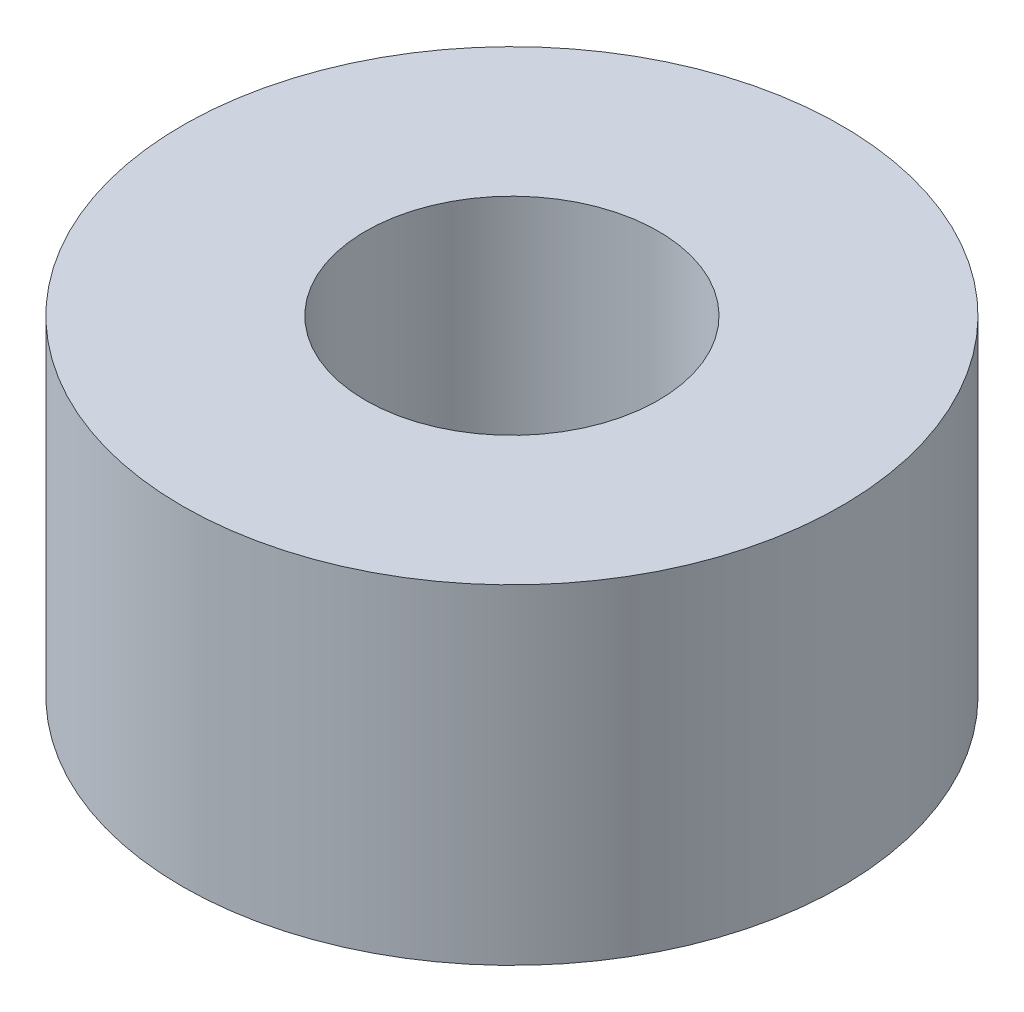
ISO-10303-21;
HEADER;
FILE_DESCRIPTION(('STEP AP214'),'2;1');
FILE_NAME('part.step','',(''),(''),'','','');
FILE_SCHEMA(('AUTOMOTIVE_DESIGN { 1 0 10303 214 1 1 1 1 }'));
ENDSEC;
DATA;
#1=APPLICATION_CONTEXT('core data for automotive mechanical design processes');
#2=APPLICATION_PROTOCOL_DEFINITION('international standard','automotive_design',2000,#1);
#3=PRODUCT_CONTEXT('',#1,'mechanical');
#4=PRODUCT('Part','Part','',(#3));
#5=PRODUCT_RELATED_PRODUCT_CATEGORY('part','',(#4));
#6=PRODUCT_DEFINITION_FORMATION('','',#4);
#7=PRODUCT_DEFINITION_CONTEXT('part definition',#1,'design');
#8=PRODUCT_DEFINITION('design','',#6,#7);
#9=PRODUCT_DEFINITION_SHAPE('','',#8);
#10=(LENGTH_UNIT() NAMED_UNIT(*) SI_UNIT(.MILLI.,.METRE.));
#11=(NAMED_UNIT(*) PLANE_ANGLE_UNIT() SI_UNIT($,.RADIAN.));
#12=(NAMED_UNIT(*) SI_UNIT($,.STERADIAN.) SOLID_ANGLE_UNIT());
#13=UNCERTAINTY_MEASURE_WITH_UNIT(LENGTH_MEASURE(1.E-05),#10,'distance_accuracy_value','');
#14=(GEOMETRIC_REPRESENTATION_CONTEXT(3) GLOBAL_UNCERTAINTY_ASSIGNED_CONTEXT((#13)) GLOBAL_UNIT_ASSIGNED_CONTEXT((#10,
#11,#12)) REPRESENTATION_CONTEXT('',''));
#15=CARTESIAN_POINT('',(0.,0.,0.));
#16=DIRECTION('',(0.,0.,1.));
#17=DIRECTION('',(1.,0.,0.));
#18=AXIS2_PLACEMENT_3D('',#15,#16,#17);
#19=CARTESIAN_POINT('',(0.,4.5,0.));
#20=DIRECTION('',(0.,1.,0.));
#21=DIRECTION('',(0.,0.,1.));
#22=AXIS2_PLACEMENT_3D('',#19,#20,#21);
#23=PLANE('',#22);
#24=CARTESIAN_POINT('',(0.,4.5,0.));
#25=DIRECTION('',(0.,1.,0.));
#26=DIRECTION('',(0.,0.,1.));
#27=AXIS2_PLACEMENT_3D('',#24,#25,#26);
#28=CIRCLE('',#27,4.5);
#29=CARTESIAN_POINT('',(0.,4.5,4.5));
#30=VERTEX_POINT('',#29);
#31=EDGE_CURVE('E10',#30,#30,#28,.T.);
#32=ORIENTED_EDGE('',*,*,#31,.T.);
#33=EDGE_LOOP('',(#32));
#34=FACE_BOUND('',#33,.T.);
#35=CARTESIAN_POINT('',(0.,4.5,0.));
#36=DIRECTION('',(0.,1.,0.));
#37=DIRECTION('',(0.,0.,1.));
#38=AXIS2_PLACEMENT_3D('',#35,#36,#37);
#39=CIRCLE('',#38,2.);
#40=CARTESIAN_POINT('',(0.,4.5,2.));
#41=VERTEX_POINT('',#40);
#42=EDGE_CURVE('E56',#41,#41,#39,.T.);
#43=ORIENTED_EDGE('',*,*,#42,.F.);
#44=EDGE_LOOP('',(#43));
#45=FACE_BOUND('',#44,.T.);
#46=ADVANCED_FACE('F43',(#34,#45),#23,.T.);
#47=CARTESIAN_POINT('',(0.,0.,0.));
#48=DIRECTION('',(0.,1.,0.));
#49=DIRECTION('',(0.,0.,1.));
#50=AXIS2_PLACEMENT_3D('',#47,#48,#49);
#51=PLANE('',#50);
#52=CARTESIAN_POINT('',(0.,0.,0.));
#53=DIRECTION('',(0.,1.,0.));
#54=DIRECTION('',(0.,0.,1.));
#55=AXIS2_PLACEMENT_3D('',#52,#53,#54);
#56=CIRCLE('',#55,4.5);
#57=CARTESIAN_POINT('',(0.,0.,4.5));
#58=VERTEX_POINT('',#57);
#59=EDGE_CURVE('E47',#58,#58,#56,.T.);
#60=ORIENTED_EDGE('',*,*,#59,.F.);
#61=EDGE_LOOP('',(#60));
#62=FACE_BOUND('',#61,.T.);
#63=CARTESIAN_POINT('',(0.,0.,0.));
#64=DIRECTION('',(0.,1.,0.));
#65=DIRECTION('',(0.,0.,1.));
#66=AXIS2_PLACEMENT_3D('',#63,#64,#65);
#67=CIRCLE('',#66,2.);
#68=CARTESIAN_POINT('',(0.,0.,2.));
#69=VERTEX_POINT('',#68);
#70=EDGE_CURVE('E58',#69,#69,#67,.T.);
#71=ORIENTED_EDGE('',*,*,#70,.T.);
#72=EDGE_LOOP('',(#71));
#73=FACE_BOUND('',#72,.T.);
#74=ADVANCED_FACE('F70',(#62,#73),#51,.F.);
#75=CARTESIAN_POINT('',(0.,4.5,0.));
#76=DIRECTION('',(0.,-1.,0.));
#77=DIRECTION('',(0.,0.,-1.));
#78=AXIS2_PLACEMENT_3D('',#75,#76,#77);
#79=CYLINDRICAL_SURFACE('',#78,4.5);
#80=ORIENTED_EDGE('',*,*,#31,.F.);
#81=EDGE_LOOP('',(#80));
#82=FACE_BOUND('',#81,.T.);
#83=ORIENTED_EDGE('',*,*,#59,.T.);
#84=EDGE_LOOP('',(#83));
#85=FACE_BOUND('',#84,.T.);
#86=ADVANCED_FACE('F45',(#82,#85),#79,.T.);
#87=CARTESIAN_POINT('',(0.,4.5,0.));
#88=DIRECTION('',(0.,-1.,0.));
#89=DIRECTION('',(0.,0.,-1.));
#90=AXIS2_PLACEMENT_3D('',#87,#88,#89);
#91=CYLINDRICAL_SURFACE('',#90,2.);
#92=ORIENTED_EDGE('',*,*,#42,.T.);
#93=EDGE_LOOP('',(#92));
#94=FACE_BOUND('',#93,.T.);
#95=ORIENTED_EDGE('',*,*,#70,.F.);
#96=EDGE_LOOP('',(#95));
#97=FACE_BOUND('',#96,.T.);
#98=ADVANCED_FACE('F66',(#94,#97),#91,.F.);
#99=CLOSED_SHELL('',(#46,#74,#86,#98));
#100=MANIFOLD_SOLID_BREP('B2',#99);
#101=ADVANCED_BREP_SHAPE_REPRESENTATION('',(#18,#100),#14);
#102=SHAPE_DEFINITION_REPRESENTATION(#9,#101);
ENDSEC;
END-ISO-10303-21;
